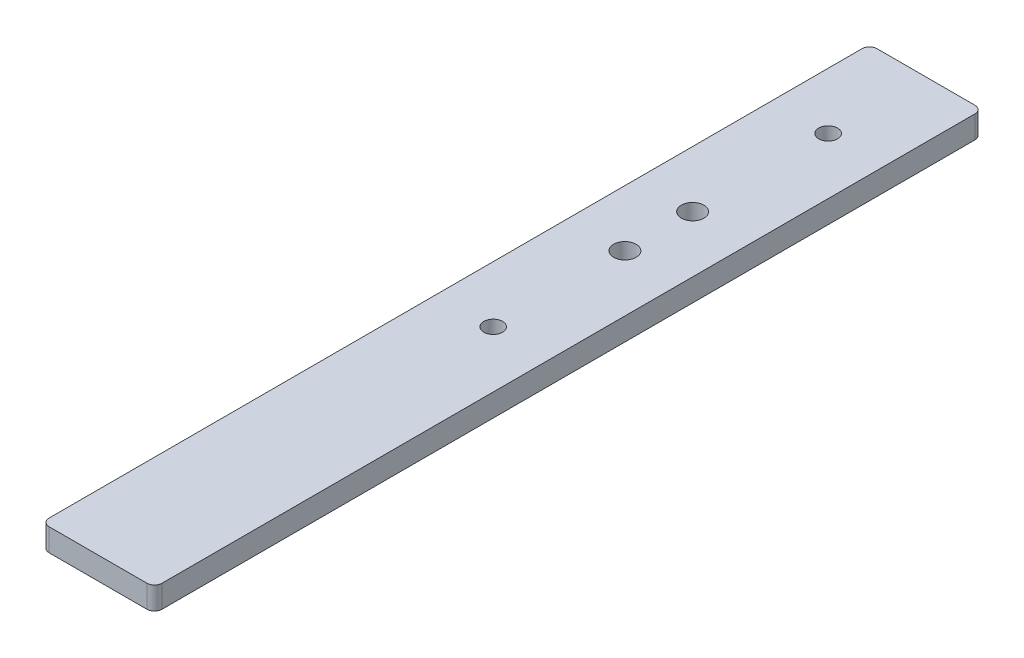
ISO-10303-21;
HEADER;
FILE_DESCRIPTION(('STEP AP214'),'2;1');
FILE_NAME('part.step','',(''),(''),'','','');
FILE_SCHEMA(('AUTOMOTIVE_DESIGN { 1 0 10303 214 1 1 1 1 }'));
ENDSEC;
DATA;
#1=APPLICATION_CONTEXT('core data for automotive mechanical design processes');
#2=APPLICATION_PROTOCOL_DEFINITION('international standard','automotive_design',2000,#1);
#3=PRODUCT_CONTEXT('',#1,'mechanical');
#4=PRODUCT('Part','Part','',(#3));
#5=PRODUCT_RELATED_PRODUCT_CATEGORY('part','',(#4));
#6=PRODUCT_DEFINITION_FORMATION('','',#4);
#7=PRODUCT_DEFINITION_CONTEXT('part definition',#1,'design');
#8=PRODUCT_DEFINITION('design','',#6,#7);
#9=PRODUCT_DEFINITION_SHAPE('','',#8);
#10=(LENGTH_UNIT() NAMED_UNIT(*) SI_UNIT(.MILLI.,.METRE.));
#11=(NAMED_UNIT(*) PLANE_ANGLE_UNIT() SI_UNIT($,.RADIAN.));
#12=(NAMED_UNIT(*) SI_UNIT($,.STERADIAN.) SOLID_ANGLE_UNIT());
#13=UNCERTAINTY_MEASURE_WITH_UNIT(LENGTH_MEASURE(1.E-05),#10,'distance_accuracy_value','');
#14=(GEOMETRIC_REPRESENTATION_CONTEXT(3) GLOBAL_UNCERTAINTY_ASSIGNED_CONTEXT((#13)) GLOBAL_UNIT_ASSIGNED_CONTEXT((#10,
#11,#12)) REPRESENTATION_CONTEXT('',''));
#15=CARTESIAN_POINT('',(0.,0.,0.));
#16=DIRECTION('',(0.,0.,1.));
#17=DIRECTION('',(1.,0.,0.));
#18=AXIS2_PLACEMENT_3D('',#15,#16,#17);
#19=CARTESIAN_POINT('',(0.,3.,0.));
#20=DIRECTION('',(1.,0.,0.));
#21=DIRECTION('',(0.,0.,1.));
#22=AXIS2_PLACEMENT_3D('',#19,#20,#21);
#23=PLANE('',#22);
#24=DIRECTION('',(0.,0.,-1.));
#25=VECTOR('',#24,1.);
#26=CARTESIAN_POINT('',(0.,3.,0.));
#27=LINE('',#26,#25);
#28=CARTESIAN_POINT('',(0.,3.,109.));
#29=VERTEX_POINT('',#28);
#30=CARTESIAN_POINT('',(0.,3.,1.));
#31=VERTEX_POINT('',#30);
#32=EDGE_CURVE('E130',#29,#31,#27,.T.);
#33=ORIENTED_EDGE('',*,*,#32,.T.);
#34=DIRECTION('',(0.,-1.,0.));
#35=VECTOR('',#34,1.);
#36=CARTESIAN_POINT('',(0.,3.,1.));
#37=LINE('',#36,#35);
#38=CARTESIAN_POINT('',(0.,0.,1.));
#39=VERTEX_POINT('',#38);
#40=EDGE_CURVE('E154',#39,#31,#37,.F.);
#41=ORIENTED_EDGE('',*,*,#40,.F.);
#42=DIRECTION('',(0.,0.,-1.));
#43=VECTOR('',#42,1.);
#44=CARTESIAN_POINT('',(0.,0.,0.));
#45=LINE('',#44,#43);
#46=CARTESIAN_POINT('',(0.,0.,109.));
#47=VERTEX_POINT('',#46);
#48=EDGE_CURVE('E177',#47,#39,#45,.T.);
#49=ORIENTED_EDGE('',*,*,#48,.F.);
#50=DIRECTION('',(0.,-1.,0.));
#51=VECTOR('',#50,1.);
#52=CARTESIAN_POINT('',(0.,3.,109.));
#53=LINE('',#52,#51);
#54=EDGE_CURVE('E156',#29,#47,#53,.T.);
#55=ORIENTED_EDGE('',*,*,#54,.F.);
#56=EDGE_LOOP('',(#33,#41,#49,#55));
#57=FACE_BOUND('',#56,.T.);
#58=ADVANCED_FACE('F37',(#57),#23,.F.);
#59=CARTESIAN_POINT('',(0.,3.,0.));
#60=DIRECTION('',(0.,0.,1.));
#61=DIRECTION('',(-1.,0.,0.));
#62=AXIS2_PLACEMENT_3D('',#59,#60,#61);
#63=PLANE('',#62);
#64=DIRECTION('',(1.,0.,0.));
#65=VECTOR('',#64,1.);
#66=CARTESIAN_POINT('',(0.,0.,0.));
#67=LINE('',#66,#65);
#68=CARTESIAN_POINT('',(1.,0.,0.));
#69=VERTEX_POINT('',#68);
#70=CARTESIAN_POINT('',(14.,0.,0.));
#71=VERTEX_POINT('',#70);
#72=EDGE_CURVE('E135',#69,#71,#67,.T.);
#73=ORIENTED_EDGE('',*,*,#72,.F.);
#74=DIRECTION('',(0.,-1.,0.));
#75=VECTOR('',#74,1.);
#76=CARTESIAN_POINT('',(1.,3.,0.));
#77=LINE('',#76,#75);
#78=CARTESIAN_POINT('',(1.,3.,0.));
#79=VERTEX_POINT('',#78);
#80=EDGE_CURVE('E46',#79,#69,#77,.T.);
#81=ORIENTED_EDGE('',*,*,#80,.F.);
#82=DIRECTION('',(1.,0.,0.));
#83=VECTOR('',#82,1.);
#84=CARTESIAN_POINT('',(0.,3.,0.));
#85=LINE('',#84,#83);
#86=CARTESIAN_POINT('',(14.,3.,0.));
#87=VERTEX_POINT('',#86);
#88=EDGE_CURVE('E133',#79,#87,#85,.T.);
#89=ORIENTED_EDGE('',*,*,#88,.T.);
#90=DIRECTION('',(0.,-1.,0.));
#91=VECTOR('',#90,1.);
#92=CARTESIAN_POINT('',(14.,3.,0.));
#93=LINE('',#92,#91);
#94=EDGE_CURVE('E11',#71,#87,#93,.F.);
#95=ORIENTED_EDGE('',*,*,#94,.F.);
#96=EDGE_LOOP('',(#73,#81,#89,#95));
#97=FACE_BOUND('',#96,.T.);
#98=ADVANCED_FACE('F198',(#97),#63,.F.);
#99=CARTESIAN_POINT('',(15.,3.,0.));
#100=DIRECTION('',(-1.,0.,0.));
#101=DIRECTION('',(0.,0.,-1.));
#102=AXIS2_PLACEMENT_3D('',#99,#100,#101);
#103=PLANE('',#102);
#104=DIRECTION('',(0.,0.,1.));
#105=VECTOR('',#104,1.);
#106=CARTESIAN_POINT('',(15.,0.,0.));
#107=LINE('',#106,#105);
#108=CARTESIAN_POINT('',(15.,0.,1.));
#109=VERTEX_POINT('',#108);
#110=CARTESIAN_POINT('',(15.,0.,109.));
#111=VERTEX_POINT('',#110);
#112=EDGE_CURVE('E111',#109,#111,#107,.T.);
#113=ORIENTED_EDGE('',*,*,#112,.F.);
#114=DIRECTION('',(0.,-1.,0.));
#115=VECTOR('',#114,1.);
#116=CARTESIAN_POINT('',(15.,3.,1.));
#117=LINE('',#116,#115);
#118=CARTESIAN_POINT('',(15.,3.,1.));
#119=VERTEX_POINT('',#118);
#120=EDGE_CURVE('E115',#119,#109,#117,.T.);
#121=ORIENTED_EDGE('',*,*,#120,.F.);
#122=DIRECTION('',(0.,0.,1.));
#123=VECTOR('',#122,1.);
#124=CARTESIAN_POINT('',(15.,3.,0.));
#125=LINE('',#124,#123);
#126=CARTESIAN_POINT('',(15.,3.,109.));
#127=VERTEX_POINT('',#126);
#128=EDGE_CURVE('E188',#119,#127,#125,.T.);
#129=ORIENTED_EDGE('',*,*,#128,.T.);
#130=DIRECTION('',(0.,-1.,0.));
#131=VECTOR('',#130,1.);
#132=CARTESIAN_POINT('',(15.,3.,109.));
#133=LINE('',#132,#131);
#134=EDGE_CURVE('E147',#111,#127,#133,.F.);
#135=ORIENTED_EDGE('',*,*,#134,.F.);
#136=EDGE_LOOP('',(#113,#121,#129,#135));
#137=FACE_BOUND('',#136,.T.);
#138=ADVANCED_FACE('F203',(#137),#103,.F.);
#139=CARTESIAN_POINT('',(0.,3.,110.));
#140=DIRECTION('',(0.,0.,-1.));
#141=DIRECTION('',(1.,0.,0.));
#142=AXIS2_PLACEMENT_3D('',#139,#140,#141);
#143=PLANE('',#142);
#144=DIRECTION('',(-1.,0.,0.));
#145=VECTOR('',#144,1.);
#146=CARTESIAN_POINT('',(0.,3.,110.));
#147=LINE('',#146,#145);
#148=CARTESIAN_POINT('',(14.,3.,110.));
#149=VERTEX_POINT('',#148);
#150=CARTESIAN_POINT('',(1.,3.,110.));
#151=VERTEX_POINT('',#150);
#152=EDGE_CURVE('E139',#149,#151,#147,.T.);
#153=ORIENTED_EDGE('',*,*,#152,.T.);
#154=DIRECTION('',(0.,-1.,0.));
#155=VECTOR('',#154,1.);
#156=CARTESIAN_POINT('',(1.,3.,110.));
#157=LINE('',#156,#155);
#158=CARTESIAN_POINT('',(1.,0.,110.));
#159=VERTEX_POINT('',#158);
#160=EDGE_CURVE('E126',#159,#151,#157,.F.);
#161=ORIENTED_EDGE('',*,*,#160,.F.);
#162=DIRECTION('',(-1.,0.,0.));
#163=VECTOR('',#162,1.);
#164=CARTESIAN_POINT('',(0.,0.,110.));
#165=LINE('',#164,#163);
#166=CARTESIAN_POINT('',(14.,0.,110.));
#167=VERTEX_POINT('',#166);
#168=EDGE_CURVE('E108',#167,#159,#165,.T.);
#169=ORIENTED_EDGE('',*,*,#168,.F.);
#170=DIRECTION('',(0.,-1.,0.));
#171=VECTOR('',#170,1.);
#172=CARTESIAN_POINT('',(14.,3.,110.));
#173=LINE('',#172,#171);
#174=EDGE_CURVE('E119',#149,#167,#173,.T.);
#175=ORIENTED_EDGE('',*,*,#174,.F.);
#176=EDGE_LOOP('',(#153,#161,#169,#175));
#177=FACE_BOUND('',#176,.T.);
#178=ADVANCED_FACE('F128',(#177),#143,.F.);
#179=CARTESIAN_POINT('',(0.,3.,0.));
#180=DIRECTION('',(0.,-1.,0.));
#181=DIRECTION('',(0.,0.,1.));
#182=AXIS2_PLACEMENT_3D('',#179,#180,#181);
#183=PLANE('',#182);
#184=CARTESIAN_POINT('',(7.5,3.,40.));
#185=DIRECTION('',(0.,-1.,0.));
#186=DIRECTION('',(0.,0.,-1.));
#187=AXIS2_PLACEMENT_3D('',#184,#185,#186);
#188=CIRCLE('',#187,1.5);
#189=CARTESIAN_POINT('',(7.5,3.,38.5));
#190=VERTEX_POINT('',#189);
#191=EDGE_CURVE('E161',#190,#190,#188,.T.);
#192=ORIENTED_EDGE('',*,*,#191,.T.);
#193=EDGE_LOOP('',(#192));
#194=FACE_BOUND('',#193,.T.);
#195=CARTESIAN_POINT('',(7.5,3.,31.));
#196=DIRECTION('',(0.,-1.,0.));
#197=DIRECTION('',(0.,0.,-1.));
#198=AXIS2_PLACEMENT_3D('',#195,#196,#197);
#199=CIRCLE('',#198,1.5);
#200=CARTESIAN_POINT('',(7.5,3.,29.5));
#201=VERTEX_POINT('',#200);
#202=EDGE_CURVE('E167',#201,#201,#199,.T.);
#203=ORIENTED_EDGE('',*,*,#202,.T.);
#204=EDGE_LOOP('',(#203));
#205=FACE_BOUND('',#204,.T.);
#206=CARTESIAN_POINT('',(7.5,3.,13.));
#207=DIRECTION('',(0.,-1.,0.));
#208=DIRECTION('',(0.,0.,-1.));
#209=AXIS2_PLACEMENT_3D('',#206,#207,#208);
#210=CIRCLE('',#209,1.25);
#211=CARTESIAN_POINT('',(7.5,3.,11.75));
#212=VERTEX_POINT('',#211);
#213=EDGE_CURVE('E178',#212,#212,#210,.T.);
#214=ORIENTED_EDGE('',*,*,#213,.T.);
#215=EDGE_LOOP('',(#214));
#216=FACE_BOUND('',#215,.T.);
#217=CARTESIAN_POINT('',(7.5,3.,57.5));
#218=DIRECTION('',(0.,-1.,0.));
#219=DIRECTION('',(0.,0.,-1.));
#220=AXIS2_PLACEMENT_3D('',#217,#218,#219);
#221=CIRCLE('',#220,1.25);
#222=CARTESIAN_POINT('',(7.5,3.,56.25));
#223=VERTEX_POINT('',#222);
#224=EDGE_CURVE('E165',#223,#223,#221,.T.);
#225=ORIENTED_EDGE('',*,*,#224,.T.);
#226=EDGE_LOOP('',(#225));
#227=FACE_BOUND('',#226,.T.);
#228=ORIENTED_EDGE('',*,*,#128,.F.);
#229=CARTESIAN_POINT('',(14.,3.,1.));
#230=DIRECTION('',(0.,1.,0.));
#231=DIRECTION('',(0.,0.,1.));
#232=AXIS2_PLACEMENT_3D('',#229,#230,#231);
#233=CIRCLE('',#232,1.);
#234=EDGE_CURVE('E54',#87,#119,#233,.F.);
#235=ORIENTED_EDGE('',*,*,#234,.F.);
#236=ORIENTED_EDGE('',*,*,#88,.F.);
#237=CARTESIAN_POINT('',(1.,3.,1.));
#238=DIRECTION('',(0.,1.,0.));
#239=DIRECTION('',(0.,0.,1.));
#240=AXIS2_PLACEMENT_3D('',#237,#238,#239);
#241=CIRCLE('',#240,1.);
#242=EDGE_CURVE('E61',#31,#79,#241,.F.);
#243=ORIENTED_EDGE('',*,*,#242,.F.);
#244=ORIENTED_EDGE('',*,*,#32,.F.);
#245=CARTESIAN_POINT('',(1.,3.,109.));
#246=DIRECTION('',(0.,1.,0.));
#247=DIRECTION('',(0.,0.,1.));
#248=AXIS2_PLACEMENT_3D('',#245,#246,#247);
#249=CIRCLE('',#248,1.);
#250=EDGE_CURVE('E151',#151,#29,#249,.F.);
#251=ORIENTED_EDGE('',*,*,#250,.F.);
#252=ORIENTED_EDGE('',*,*,#152,.F.);
#253=CARTESIAN_POINT('',(14.,3.,109.));
#254=DIRECTION('',(0.,1.,0.));
#255=DIRECTION('',(0.,0.,1.));
#256=AXIS2_PLACEMENT_3D('',#253,#254,#255);
#257=CIRCLE('',#256,1.);
#258=EDGE_CURVE('E121',#127,#149,#257,.F.);
#259=ORIENTED_EDGE('',*,*,#258,.F.);
#260=EDGE_LOOP('',(#228,#235,#236,#243,#244,#251,#252,#259));
#261=FACE_BOUND('',#260,.T.);
#262=ADVANCED_FACE('F204',(#194,#205,#216,#227,#261),#183,.F.);
#263=CARTESIAN_POINT('',(0.,0.,0.));
#264=DIRECTION('',(0.,-1.,0.));
#265=DIRECTION('',(0.,0.,1.));
#266=AXIS2_PLACEMENT_3D('',#263,#264,#265);
#267=PLANE('',#266);
#268=CARTESIAN_POINT('',(7.5,0.,40.));
#269=DIRECTION('',(0.,1.,0.));
#270=DIRECTION('',(0.,0.,1.));
#271=AXIS2_PLACEMENT_3D('',#268,#269,#270);
#272=CIRCLE('',#271,1.5);
#273=CARTESIAN_POINT('',(7.5,0.,41.5));
#274=VERTEX_POINT('',#273);
#275=EDGE_CURVE('E41',#274,#274,#272,.T.);
#276=ORIENTED_EDGE('',*,*,#275,.T.);
#277=EDGE_LOOP('',(#276));
#278=FACE_BOUND('',#277,.T.);
#279=CARTESIAN_POINT('',(7.5,0.,31.));
#280=DIRECTION('',(0.,1.,0.));
#281=DIRECTION('',(0.,0.,1.));
#282=AXIS2_PLACEMENT_3D('',#279,#280,#281);
#283=CIRCLE('',#282,1.5);
#284=CARTESIAN_POINT('',(7.5,0.,32.5));
#285=VERTEX_POINT('',#284);
#286=EDGE_CURVE('E159',#285,#285,#283,.T.);
#287=ORIENTED_EDGE('',*,*,#286,.T.);
#288=EDGE_LOOP('',(#287));
#289=FACE_BOUND('',#288,.T.);
#290=CARTESIAN_POINT('',(7.5,0.,13.));
#291=DIRECTION('',(0.,-1.,0.));
#292=DIRECTION('',(0.,0.,-1.));
#293=AXIS2_PLACEMENT_3D('',#290,#291,#292);
#294=CIRCLE('',#293,1.25);
#295=CARTESIAN_POINT('',(7.5,0.,11.75));
#296=VERTEX_POINT('',#295);
#297=EDGE_CURVE('E174',#296,#296,#294,.T.);
#298=ORIENTED_EDGE('',*,*,#297,.F.);
#299=EDGE_LOOP('',(#298));
#300=FACE_BOUND('',#299,.T.);
#301=CARTESIAN_POINT('',(7.5,0.,57.5));
#302=DIRECTION('',(0.,-1.,0.));
#303=DIRECTION('',(0.,0.,-1.));
#304=AXIS2_PLACEMENT_3D('',#301,#302,#303);
#305=CIRCLE('',#304,1.25);
#306=CARTESIAN_POINT('',(7.5,0.,56.25));
#307=VERTEX_POINT('',#306);
#308=EDGE_CURVE('E181',#307,#307,#305,.T.);
#309=ORIENTED_EDGE('',*,*,#308,.F.);
#310=EDGE_LOOP('',(#309));
#311=FACE_BOUND('',#310,.T.);
#312=ORIENTED_EDGE('',*,*,#168,.T.);
#313=CARTESIAN_POINT('',(1.,0.,109.));
#314=DIRECTION('',(0.,1.,0.));
#315=DIRECTION('',(0.,0.,1.));
#316=AXIS2_PLACEMENT_3D('',#313,#314,#315);
#317=CIRCLE('',#316,1.);
#318=EDGE_CURVE('E116',#47,#159,#317,.T.);
#319=ORIENTED_EDGE('',*,*,#318,.F.);
#320=ORIENTED_EDGE('',*,*,#48,.T.);
#321=CARTESIAN_POINT('',(1.,0.,1.));
#322=DIRECTION('',(0.,1.,0.));
#323=DIRECTION('',(0.,0.,1.));
#324=AXIS2_PLACEMENT_3D('',#321,#322,#323);
#325=CIRCLE('',#324,1.);
#326=EDGE_CURVE('E125',#69,#39,#325,.T.);
#327=ORIENTED_EDGE('',*,*,#326,.F.);
#328=ORIENTED_EDGE('',*,*,#72,.T.);
#329=CARTESIAN_POINT('',(14.,0.,1.));
#330=DIRECTION('',(0.,1.,0.));
#331=DIRECTION('',(0.,0.,1.));
#332=AXIS2_PLACEMENT_3D('',#329,#330,#331);
#333=CIRCLE('',#332,1.);
#334=EDGE_CURVE('E142',#109,#71,#333,.T.);
#335=ORIENTED_EDGE('',*,*,#334,.F.);
#336=ORIENTED_EDGE('',*,*,#112,.T.);
#337=CARTESIAN_POINT('',(14.,0.,109.));
#338=DIRECTION('',(0.,1.,0.));
#339=DIRECTION('',(0.,0.,1.));
#340=AXIS2_PLACEMENT_3D('',#337,#338,#339);
#341=CIRCLE('',#340,1.);
#342=EDGE_CURVE('E104',#167,#111,#341,.T.);
#343=ORIENTED_EDGE('',*,*,#342,.F.);
#344=EDGE_LOOP('',(#312,#319,#320,#327,#328,#335,#336,#343));
#345=FACE_BOUND('',#344,.T.);
#346=ADVANCED_FACE('F106',(#278,#289,#300,#311,#345),#267,.T.);
#347=CARTESIAN_POINT('',(14.,3.,109.));
#348=DIRECTION('',(0.,-1.,0.));
#349=DIRECTION('',(0.,0.,1.));
#350=AXIS2_PLACEMENT_3D('',#347,#348,#349);
#351=CYLINDRICAL_SURFACE('',#350,1.);
#352=ORIENTED_EDGE('',*,*,#258,.T.);
#353=ORIENTED_EDGE('',*,*,#174,.T.);
#354=ORIENTED_EDGE('',*,*,#342,.T.);
#355=ORIENTED_EDGE('',*,*,#134,.T.);
#356=EDGE_LOOP('',(#352,#353,#354,#355));
#357=FACE_BOUND('',#356,.T.);
#358=ADVANCED_FACE('F120',(#357),#351,.T.);
#359=CARTESIAN_POINT('',(1.,3.,109.));
#360=DIRECTION('',(0.,-1.,0.));
#361=DIRECTION('',(0.,0.,1.));
#362=AXIS2_PLACEMENT_3D('',#359,#360,#361);
#363=CYLINDRICAL_SURFACE('',#362,1.);
#364=ORIENTED_EDGE('',*,*,#250,.T.);
#365=ORIENTED_EDGE('',*,*,#54,.T.);
#366=ORIENTED_EDGE('',*,*,#318,.T.);
#367=ORIENTED_EDGE('',*,*,#160,.T.);
#368=EDGE_LOOP('',(#364,#365,#366,#367));
#369=FACE_BOUND('',#368,.T.);
#370=ADVANCED_FACE('F208',(#369),#363,.T.);
#371=CARTESIAN_POINT('',(14.,3.,1.));
#372=DIRECTION('',(0.,-1.,0.));
#373=DIRECTION('',(0.,0.,1.));
#374=AXIS2_PLACEMENT_3D('',#371,#372,#373);
#375=CYLINDRICAL_SURFACE('',#374,1.);
#376=ORIENTED_EDGE('',*,*,#234,.T.);
#377=ORIENTED_EDGE('',*,*,#120,.T.);
#378=ORIENTED_EDGE('',*,*,#334,.T.);
#379=ORIENTED_EDGE('',*,*,#94,.T.);
#380=EDGE_LOOP('',(#376,#377,#378,#379));
#381=FACE_BOUND('',#380,.T.);
#382=ADVANCED_FACE('F200',(#381),#375,.T.);
#383=CARTESIAN_POINT('',(1.,3.,1.));
#384=DIRECTION('',(0.,-1.,0.));
#385=DIRECTION('',(0.,0.,1.));
#386=AXIS2_PLACEMENT_3D('',#383,#384,#385);
#387=CYLINDRICAL_SURFACE('',#386,1.);
#388=ORIENTED_EDGE('',*,*,#242,.T.);
#389=ORIENTED_EDGE('',*,*,#80,.T.);
#390=ORIENTED_EDGE('',*,*,#326,.T.);
#391=ORIENTED_EDGE('',*,*,#40,.T.);
#392=EDGE_LOOP('',(#388,#389,#390,#391));
#393=FACE_BOUND('',#392,.T.);
#394=ADVANCED_FACE('F39',(#393),#387,.T.);
#395=CARTESIAN_POINT('',(7.5,0.,57.5));
#396=DIRECTION('',(0.,1.,0.));
#397=DIRECTION('',(0.,0.,-1.));
#398=AXIS2_PLACEMENT_3D('',#395,#396,#397);
#399=CYLINDRICAL_SURFACE('',#398,1.25);
#400=ORIENTED_EDGE('',*,*,#308,.T.);
#401=EDGE_LOOP('',(#400));
#402=FACE_BOUND('',#401,.T.);
#403=ORIENTED_EDGE('',*,*,#224,.F.);
#404=EDGE_LOOP('',(#403));
#405=FACE_BOUND('',#404,.T.);
#406=ADVANCED_FACE('F213',(#402,#405),#399,.F.);
#407=CARTESIAN_POINT('',(7.5,0.,13.));
#408=DIRECTION('',(0.,1.,0.));
#409=DIRECTION('',(0.,0.,-1.));
#410=AXIS2_PLACEMENT_3D('',#407,#408,#409);
#411=CYLINDRICAL_SURFACE('',#410,1.25);
#412=ORIENTED_EDGE('',*,*,#297,.T.);
#413=EDGE_LOOP('',(#412));
#414=FACE_BOUND('',#413,.T.);
#415=ORIENTED_EDGE('',*,*,#213,.F.);
#416=EDGE_LOOP('',(#415));
#417=FACE_BOUND('',#416,.T.);
#418=ADVANCED_FACE('F218',(#414,#417),#411,.F.);
#419=CARTESIAN_POINT('',(7.5,-7.,31.));
#420=DIRECTION('',(0.,1.,0.));
#421=DIRECTION('',(0.,0.,-1.));
#422=AXIS2_PLACEMENT_3D('',#419,#420,#421);
#423=CYLINDRICAL_SURFACE('',#422,1.5);
#424=ORIENTED_EDGE('',*,*,#286,.F.);
#425=EDGE_LOOP('',(#424));
#426=FACE_BOUND('',#425,.T.);
#427=ORIENTED_EDGE('',*,*,#202,.F.);
#428=EDGE_LOOP('',(#427));
#429=FACE_BOUND('',#428,.T.);
#430=ADVANCED_FACE('F260',(#426,#429),#423,.F.);
#431=CARTESIAN_POINT('',(7.5,-7.,40.));
#432=DIRECTION('',(0.,1.,0.));
#433=DIRECTION('',(0.,0.,-1.));
#434=AXIS2_PLACEMENT_3D('',#431,#432,#433);
#435=CYLINDRICAL_SURFACE('',#434,1.5);
#436=ORIENTED_EDGE('',*,*,#275,.F.);
#437=EDGE_LOOP('',(#436));
#438=FACE_BOUND('',#437,.T.);
#439=ORIENTED_EDGE('',*,*,#191,.F.);
#440=EDGE_LOOP('',(#439));
#441=FACE_BOUND('',#440,.T.);
#442=ADVANCED_FACE('F270',(#438,#441),#435,.F.);
#443=CLOSED_SHELL('',(#58,#98,#138,#178,#262,#346,#358,#370,#382,#394,#406,#418,#430,#442));
#444=MANIFOLD_SOLID_BREP('B2',#443);
#445=ADVANCED_BREP_SHAPE_REPRESENTATION('',(#18,#444),#14);
#446=SHAPE_DEFINITION_REPRESENTATION(#9,#445);
ENDSEC;
END-ISO-10303-21;
